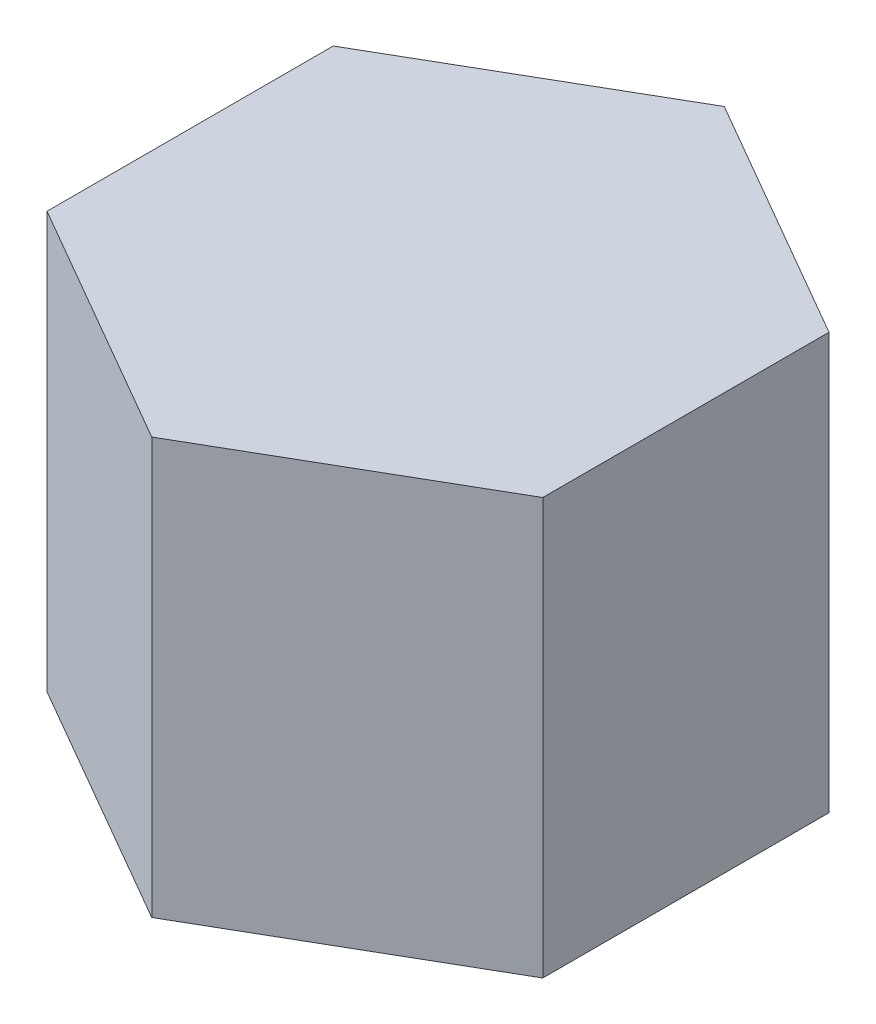
ISO-10303-21;
HEADER;
FILE_DESCRIPTION(('STEP AP214'),'2;1');
FILE_NAME('part.step','',(''),(''),'','','');
FILE_SCHEMA(('AUTOMOTIVE_DESIGN { 1 0 10303 214 1 1 1 1 }'));
ENDSEC;
DATA;
#1=APPLICATION_CONTEXT('core data for automotive mechanical design processes');
#2=APPLICATION_PROTOCOL_DEFINITION('international standard','automotive_design',2000,#1);
#3=PRODUCT_CONTEXT('',#1,'mechanical');
#4=PRODUCT('Part','Part','',(#3));
#5=PRODUCT_RELATED_PRODUCT_CATEGORY('part','',(#4));
#6=PRODUCT_DEFINITION_FORMATION('','',#4);
#7=PRODUCT_DEFINITION_CONTEXT('part definition',#1,'design');
#8=PRODUCT_DEFINITION('design','',#6,#7);
#9=PRODUCT_DEFINITION_SHAPE('','',#8);
#10=(LENGTH_UNIT() NAMED_UNIT(*) SI_UNIT(.MILLI.,.METRE.));
#11=(NAMED_UNIT(*) PLANE_ANGLE_UNIT() SI_UNIT($,.RADIAN.));
#12=(NAMED_UNIT(*) SI_UNIT($,.STERADIAN.) SOLID_ANGLE_UNIT());
#13=UNCERTAINTY_MEASURE_WITH_UNIT(LENGTH_MEASURE(1.E-05),#10,'distance_accuracy_value','');
#14=(GEOMETRIC_REPRESENTATION_CONTEXT(3) GLOBAL_UNCERTAINTY_ASSIGNED_CONTEXT((#13)) GLOBAL_UNIT_ASSIGNED_CONTEXT((#10,
#11,#12)) REPRESENTATION_CONTEXT('',''));
#15=CARTESIAN_POINT('',(0.,0.,0.));
#16=DIRECTION('',(0.,0.,1.));
#17=DIRECTION('',(1.,0.,0.));
#18=AXIS2_PLACEMENT_3D('',#15,#16,#17);
#19=CARTESIAN_POINT('',(207.839551417382,-147.556598747966,289.083895009141));
#20=DIRECTION('',(-0.499999999999943,0.,-0.866025403784471));
#21=DIRECTION('',(-0.866025403784471,0.,0.499999999999943));
#22=AXIS2_PLACEMENT_3D('',#19,#20,#21);
#23=PLANE('',#22);
#24=CARTESIAN_POINT('',(208.142660308706,-147.047793579175,288.908895009141));
#25=DIRECTION('',(-0.866025403784471,0.,0.499999999999943));
#26=VECTOR('',#25,1.);
#27=LINE('',#24,#26);
#28=CARTESIAN_POINT('',(208.142660308706,-147.047793579175,288.908895009141));
#29=VERTEX_POINT('',#28);
#30=CARTESIAN_POINT('',(207.839551417382,-147.047793579175,289.083895009141));
#31=VERTEX_POINT('',#30);
#32=EDGE_CURVE('E170',#29,#31,#27,.T.);
#33=ORIENTED_EDGE('',*,*,#32,.T.);
#34=CARTESIAN_POINT('',(207.839551417382,-147.556598747966,289.083895009141));
#35=DIRECTION('',(0.,1.,0.));
#36=VECTOR('',#35,1.);
#37=LINE('',#34,#36);
#38=CARTESIAN_POINT('',(207.839551417382,-147.556598747966,289.083895009141));
#39=VERTEX_POINT('',#38);
#40=EDGE_CURVE('E35',#39,#31,#37,.T.);
#41=ORIENTED_EDGE('',*,*,#40,.F.);
#42=CARTESIAN_POINT('',(208.142660308706,-147.556598747966,288.908895009141));
#43=DIRECTION('',(-0.866025403784471,0.,0.499999999999943));
#44=VECTOR('',#43,1.);
#45=LINE('',#42,#44);
#46=CARTESIAN_POINT('',(208.142660308706,-147.556598747966,288.908895009141));
#47=VERTEX_POINT('',#46);
#48=EDGE_CURVE('E159',#47,#39,#45,.T.);
#49=ORIENTED_EDGE('',*,*,#48,.F.);
#50=CARTESIAN_POINT('',(208.142660308706,-147.556598747966,288.908895009141));
#51=DIRECTION('',(0.,1.,0.));
#52=VECTOR('',#51,1.);
#53=LINE('',#50,#52);
#54=EDGE_CURVE('E10',#47,#29,#53,.T.);
#55=ORIENTED_EDGE('',*,*,#54,.T.);
#56=EDGE_LOOP('',(#33,#41,#49,#55));
#57=FACE_BOUND('',#56,.T.);
#58=ADVANCED_FACE('F16',(#57),#23,.F.);
#59=CARTESIAN_POINT('',(208.142660308706,-147.556598747966,291.594471220494));
#60=DIRECTION('',(-1.,0.,0.));
#61=DIRECTION('',(0.,-1.,0.));
#62=AXIS2_PLACEMENT_3D('',#59,#60,#61);
#63=PLANE('',#62);
#64=CARTESIAN_POINT('',(208.142660308706,-147.047793579175,288.558895009141));
#65=DIRECTION('',(0.,0.,1.));
#66=VECTOR('',#65,1.);
#67=LINE('',#64,#66);
#68=CARTESIAN_POINT('',(208.142660308706,-147.047793579175,288.558895009141));
#69=VERTEX_POINT('',#68);
#70=EDGE_CURVE('E167',#69,#29,#67,.T.);
#71=ORIENTED_EDGE('',*,*,#70,.T.);
#72=ORIENTED_EDGE('',*,*,#54,.F.);
#73=CARTESIAN_POINT('',(208.142660308706,-147.556598747966,288.558895009141));
#74=DIRECTION('',(0.,0.,1.));
#75=VECTOR('',#74,1.);
#76=LINE('',#73,#75);
#77=CARTESIAN_POINT('',(208.142660308706,-147.556598747966,288.558895009141));
#78=VERTEX_POINT('',#77);
#79=EDGE_CURVE('E156',#78,#47,#76,.T.);
#80=ORIENTED_EDGE('',*,*,#79,.F.);
#81=CARTESIAN_POINT('',(208.142660308706,-147.556598747966,288.558895009141));
#82=DIRECTION('',(0.,1.,0.));
#83=VECTOR('',#82,1.);
#84=LINE('',#81,#83);
#85=EDGE_CURVE('E27',#78,#69,#84,.T.);
#86=ORIENTED_EDGE('',*,*,#85,.T.);
#87=EDGE_LOOP('',(#71,#72,#80,#86));
#88=FACE_BOUND('',#87,.T.);
#89=ADVANCED_FACE('F189',(#88),#63,.F.);
#90=CARTESIAN_POINT('',(208.142660308706,-147.556598747966,288.558895009141));
#91=DIRECTION('',(-0.499999999999943,0.,0.866025403784471));
#92=DIRECTION('',(0.866025403784471,0.,0.499999999999943));
#93=AXIS2_PLACEMENT_3D('',#90,#91,#92);
#94=PLANE('',#93);
#95=CARTESIAN_POINT('',(207.839551417382,-147.047793579175,288.383895009141));
#96=DIRECTION('',(0.866025403784471,0.,0.499999999999943));
#97=VECTOR('',#96,1.);
#98=LINE('',#95,#97);
#99=CARTESIAN_POINT('',(207.839551417382,-147.047793579175,288.383895009141));
#100=VERTEX_POINT('',#99);
#101=EDGE_CURVE('E163',#100,#69,#98,.T.);
#102=ORIENTED_EDGE('',*,*,#101,.T.);
#103=ORIENTED_EDGE('',*,*,#85,.F.);
#104=CARTESIAN_POINT('',(207.839551417382,-147.556598747966,288.383895009141));
#105=DIRECTION('',(0.866025403784471,0.,0.499999999999943));
#106=VECTOR('',#105,1.);
#107=LINE('',#104,#106);
#108=CARTESIAN_POINT('',(207.839551417382,-147.556598747966,288.383895009141));
#109=VERTEX_POINT('',#108);
#110=EDGE_CURVE('E106',#109,#78,#107,.T.);
#111=ORIENTED_EDGE('',*,*,#110,.F.);
#112=CARTESIAN_POINT('',(207.839551417382,-147.556598747966,288.383895009141));
#113=DIRECTION('',(0.,1.,0.));
#114=VECTOR('',#113,1.);
#115=LINE('',#112,#114);
#116=EDGE_CURVE('E94',#109,#100,#115,.T.);
#117=ORIENTED_EDGE('',*,*,#116,.T.);
#118=EDGE_LOOP('',(#102,#103,#111,#117));
#119=FACE_BOUND('',#118,.T.);
#120=ADVANCED_FACE('F198',(#119),#94,.F.);
#121=CARTESIAN_POINT('',(207.839551417382,-147.556598747966,288.383895009141));
#122=DIRECTION('',(0.499999999999978,0.,0.866025403784452));
#123=DIRECTION('',(0.866025403784452,0.,-0.499999999999978));
#124=AXIS2_PLACEMENT_3D('',#121,#122,#123);
#125=PLANE('',#124);
#126=CARTESIAN_POINT('',(207.536442526057,-147.047793579175,288.558895009141));
#127=DIRECTION('',(0.866025403784452,0.,-0.499999999999978));
#128=VECTOR('',#127,1.);
#129=LINE('',#126,#128);
#130=CARTESIAN_POINT('',(207.536442526057,-147.047793579175,288.558895009141));
#131=VERTEX_POINT('',#130);
#132=EDGE_CURVE('E162',#131,#100,#129,.T.);
#133=ORIENTED_EDGE('',*,*,#132,.T.);
#134=ORIENTED_EDGE('',*,*,#116,.F.);
#135=CARTESIAN_POINT('',(207.536442526057,-147.556598747966,288.558895009141));
#136=DIRECTION('',(0.866025403784452,0.,-0.499999999999978));
#137=VECTOR('',#136,1.);
#138=LINE('',#135,#137);
#139=CARTESIAN_POINT('',(207.536442526057,-147.556598747966,288.558895009141));
#140=VERTEX_POINT('',#139);
#141=EDGE_CURVE('E98',#140,#109,#138,.T.);
#142=ORIENTED_EDGE('',*,*,#141,.F.);
#143=CARTESIAN_POINT('',(207.536442526057,-147.556598747966,288.558895009141));
#144=DIRECTION('',(0.,1.,0.));
#145=VECTOR('',#144,1.);
#146=LINE('',#143,#145);
#147=EDGE_CURVE('E79',#140,#131,#146,.T.);
#148=ORIENTED_EDGE('',*,*,#147,.T.);
#149=EDGE_LOOP('',(#133,#134,#142,#148));
#150=FACE_BOUND('',#149,.T.);
#151=ADVANCED_FACE('F100',(#150),#125,.F.);
#152=CARTESIAN_POINT('',(207.536442526057,-147.556598747966,291.594471220494));
#153=DIRECTION('',(1.,0.,0.));
#154=DIRECTION('',(0.,1.,0.));
#155=AXIS2_PLACEMENT_3D('',#152,#153,#154);
#156=PLANE('',#155);
#157=CARTESIAN_POINT('',(207.536442526057,-147.047793579175,288.908895009141));
#158=DIRECTION('',(0.,0.,-1.));
#159=VECTOR('',#158,1.);
#160=LINE('',#157,#159);
#161=CARTESIAN_POINT('',(207.536442526057,-147.047793579175,288.908895009141));
#162=VERTEX_POINT('',#161);
#163=EDGE_CURVE('E88',#162,#131,#160,.T.);
#164=ORIENTED_EDGE('',*,*,#163,.T.);
#165=ORIENTED_EDGE('',*,*,#147,.F.);
#166=CARTESIAN_POINT('',(207.536442526057,-147.556598747966,288.908895009141));
#167=DIRECTION('',(0.,0.,-1.));
#168=VECTOR('',#167,1.);
#169=LINE('',#166,#168);
#170=CARTESIAN_POINT('',(207.536442526057,-147.556598747966,288.908895009141));
#171=VERTEX_POINT('',#170);
#172=EDGE_CURVE('E84',#171,#140,#169,.T.);
#173=ORIENTED_EDGE('',*,*,#172,.F.);
#174=CARTESIAN_POINT('',(207.536442526057,-147.556598747966,288.908895009141));
#175=DIRECTION('',(0.,1.,0.));
#176=VECTOR('',#175,1.);
#177=LINE('',#174,#176);
#178=EDGE_CURVE('E58',#171,#162,#177,.T.);
#179=ORIENTED_EDGE('',*,*,#178,.T.);
#180=EDGE_LOOP('',(#164,#165,#173,#179));
#181=FACE_BOUND('',#180,.T.);
#182=ADVANCED_FACE('F82',(#181),#156,.F.);
#183=CARTESIAN_POINT('',(207.536442526057,-147.556598747966,288.908895009141));
#184=DIRECTION('',(0.499999999999978,0.,-0.866025403784452));
#185=DIRECTION('',(-0.866025403784452,0.,-0.499999999999978));
#186=AXIS2_PLACEMENT_3D('',#183,#184,#185);
#187=PLANE('',#186);
#188=CARTESIAN_POINT('',(207.839551417382,-147.047793579175,289.083895009141));
#189=DIRECTION('',(-0.866025403784452,0.,-0.499999999999978));
#190=VECTOR('',#189,1.);
#191=LINE('',#188,#190);
#192=EDGE_CURVE('E160',#31,#162,#191,.T.);
#193=ORIENTED_EDGE('',*,*,#192,.T.);
#194=ORIENTED_EDGE('',*,*,#178,.F.);
#195=CARTESIAN_POINT('',(207.839551417382,-147.556598747966,289.083895009141));
#196=DIRECTION('',(-0.866025403784452,0.,-0.499999999999978));
#197=VECTOR('',#196,1.);
#198=LINE('',#195,#197);
#199=EDGE_CURVE('E112',#39,#171,#198,.T.);
#200=ORIENTED_EDGE('',*,*,#199,.F.);
#201=ORIENTED_EDGE('',*,*,#40,.T.);
#202=EDGE_LOOP('',(#193,#194,#200,#201));
#203=FACE_BOUND('',#202,.T.);
#204=ADVANCED_FACE('F131',(#203),#187,.F.);
#205=CARTESIAN_POINT('',(206.491105863044,-147.556598747966,291.594471220494));
#206=DIRECTION('',(0.,1.,0.));
#207=DIRECTION('',(-1.,0.,0.));
#208=AXIS2_PLACEMENT_3D('',#205,#206,#207);
#209=PLANE('',#208);
#210=ORIENTED_EDGE('',*,*,#48,.T.);
#211=ORIENTED_EDGE('',*,*,#199,.T.);
#212=ORIENTED_EDGE('',*,*,#172,.T.);
#213=ORIENTED_EDGE('',*,*,#141,.T.);
#214=ORIENTED_EDGE('',*,*,#110,.T.);
#215=ORIENTED_EDGE('',*,*,#79,.T.);
#216=EDGE_LOOP('',(#210,#211,#212,#213,#214,#215));
#217=FACE_BOUND('',#216,.T.);
#218=ADVANCED_FACE('F111',(#217),#209,.F.);
#219=CARTESIAN_POINT('',(206.491105863044,-147.047793579175,291.594471220494));
#220=DIRECTION('',(0.,1.,0.));
#221=DIRECTION('',(-1.,0.,0.));
#222=AXIS2_PLACEMENT_3D('',#219,#220,#221);
#223=PLANE('',#222);
#224=ORIENTED_EDGE('',*,*,#32,.F.);
#225=ORIENTED_EDGE('',*,*,#70,.F.);
#226=ORIENTED_EDGE('',*,*,#101,.F.);
#227=ORIENTED_EDGE('',*,*,#132,.F.);
#228=ORIENTED_EDGE('',*,*,#163,.F.);
#229=ORIENTED_EDGE('',*,*,#192,.F.);
#230=EDGE_LOOP('',(#224,#225,#226,#227,#228,#229));
#231=FACE_BOUND('',#230,.T.);
#232=ADVANCED_FACE('F130',(#231),#223,.T.);
#233=CLOSED_SHELL('',(#58,#89,#120,#151,#182,#204,#218,#232));
#234=MANIFOLD_SOLID_BREP('B1',#233);
#235=ADVANCED_BREP_SHAPE_REPRESENTATION('',(#18,#234),#14);
#236=SHAPE_DEFINITION_REPRESENTATION(#9,#235);
ENDSEC;
END-ISO-10303-21;
